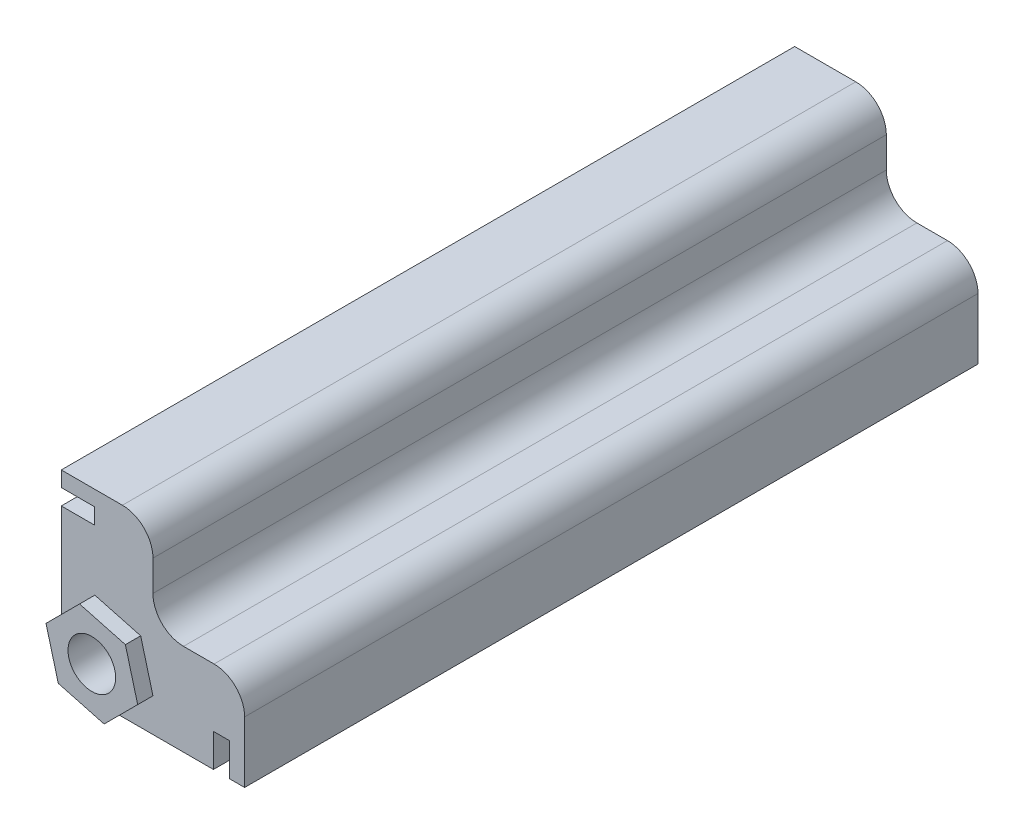
ISO-10303-21;
HEADER;
FILE_DESCRIPTION(('STEP AP214'),'2;1');
FILE_NAME('part.step','',(''),(''),'','','');
FILE_SCHEMA(('AUTOMOTIVE_DESIGN { 1 0 10303 214 1 1 1 1 }'));
ENDSEC;
DATA;
#1=APPLICATION_CONTEXT('core data for automotive mechanical design processes');
#2=APPLICATION_PROTOCOL_DEFINITION('international standard','automotive_design',2000,#1);
#3=PRODUCT_CONTEXT('',#1,'mechanical');
#4=PRODUCT('Part','Part','',(#3));
#5=PRODUCT_RELATED_PRODUCT_CATEGORY('part','',(#4));
#6=PRODUCT_DEFINITION_FORMATION('','',#4);
#7=PRODUCT_DEFINITION_CONTEXT('part definition',#1,'design');
#8=PRODUCT_DEFINITION('design','',#6,#7);
#9=PRODUCT_DEFINITION_SHAPE('','',#8);
#10=(LENGTH_UNIT() NAMED_UNIT(*) SI_UNIT(.MILLI.,.METRE.));
#11=(NAMED_UNIT(*) PLANE_ANGLE_UNIT() SI_UNIT($,.RADIAN.));
#12=(NAMED_UNIT(*) SI_UNIT($,.STERADIAN.) SOLID_ANGLE_UNIT());
#13=UNCERTAINTY_MEASURE_WITH_UNIT(LENGTH_MEASURE(1.E-05),#10,'distance_accuracy_value','');
#14=(GEOMETRIC_REPRESENTATION_CONTEXT(3) GLOBAL_UNCERTAINTY_ASSIGNED_CONTEXT((#13)) GLOBAL_UNIT_ASSIGNED_CONTEXT((#10,
#11,#12)) REPRESENTATION_CONTEXT('',''));
#15=CARTESIAN_POINT('',(0.,0.,0.));
#16=DIRECTION('',(0.,0.,1.));
#17=DIRECTION('',(1.,0.,0.));
#18=AXIS2_PLACEMENT_3D('',#15,#16,#17);
#19=CARTESIAN_POINT('',(0.,0.,152.4));
#20=DIRECTION('',(0.,0.,-1.));
#21=DIRECTION('',(-1.,0.,0.));
#22=AXIS2_PLACEMENT_3D('',#19,#20,#21);
#23=PLANE('',#22);
#24=DIRECTION('',(0.,1.,0.));
#25=VECTOR('',#24,1.);
#26=CARTESIAN_POINT('',(38.1,19.05,152.4));
#27=LINE('',#26,#25);
#28=CARTESIAN_POINT('',(38.1,0.,152.4));
#29=VERTEX_POINT('',#28);
#30=CARTESIAN_POINT('',(38.1,12.7,152.4));
#31=VERTEX_POINT('',#30);
#32=EDGE_CURVE('E278',#29,#31,#27,.T.);
#33=ORIENTED_EDGE('',*,*,#32,.T.);
#34=CARTESIAN_POINT('',(31.75,12.7,152.4));
#35=DIRECTION('',(0.,0.,-1.));
#36=DIRECTION('',(-1.,0.,0.));
#37=AXIS2_PLACEMENT_3D('',#34,#35,#36);
#38=CIRCLE('',#37,6.35);
#39=CARTESIAN_POINT('',(31.75,19.05,152.4));
#40=VERTEX_POINT('',#39);
#41=EDGE_CURVE('E336',#31,#40,#38,.F.);
#42=ORIENTED_EDGE('',*,*,#41,.T.);
#43=DIRECTION('',(-1.,0.,0.));
#44=VECTOR('',#43,1.);
#45=CARTESIAN_POINT('',(19.05,19.05,152.4));
#46=LINE('',#45,#44);
#47=CARTESIAN_POINT('',(25.4,19.05,152.4));
#48=VERTEX_POINT('',#47);
#49=EDGE_CURVE('E282',#40,#48,#46,.T.);
#50=ORIENTED_EDGE('',*,*,#49,.T.);
#51=CARTESIAN_POINT('',(25.4,25.4,152.4));
#52=DIRECTION('',(0.,0.,-1.));
#53=DIRECTION('',(-1.,0.,0.));
#54=AXIS2_PLACEMENT_3D('',#51,#52,#53);
#55=CIRCLE('',#54,6.35);
#56=CARTESIAN_POINT('',(19.05,25.4,152.4));
#57=VERTEX_POINT('',#56);
#58=EDGE_CURVE('E11',#48,#57,#55,.T.);
#59=ORIENTED_EDGE('',*,*,#58,.T.);
#60=DIRECTION('',(0.,1.,0.));
#61=VECTOR('',#60,1.);
#62=CARTESIAN_POINT('',(19.05,38.1,152.4));
#63=LINE('',#62,#61);
#64=CARTESIAN_POINT('',(19.05,31.75,152.4));
#65=VERTEX_POINT('',#64);
#66=EDGE_CURVE('E285',#57,#65,#63,.T.);
#67=ORIENTED_EDGE('',*,*,#66,.T.);
#68=CARTESIAN_POINT('',(12.7,31.75,152.4));
#69=DIRECTION('',(0.,0.,-1.));
#70=DIRECTION('',(-1.,0.,0.));
#71=AXIS2_PLACEMENT_3D('',#68,#69,#70);
#72=CIRCLE('',#71,6.35);
#73=CARTESIAN_POINT('',(12.7,38.1,152.4));
#74=VERTEX_POINT('',#73);
#75=EDGE_CURVE('E49',#65,#74,#72,.F.);
#76=ORIENTED_EDGE('',*,*,#75,.T.);
#77=DIRECTION('',(-1.,0.,0.));
#78=VECTOR('',#77,1.);
#79=CARTESIAN_POINT('',(0.,38.1,152.4));
#80=LINE('',#79,#78);
#81=CARTESIAN_POINT('',(0.,38.1,152.4));
#82=VERTEX_POINT('',#81);
#83=EDGE_CURVE('E287',#74,#82,#80,.T.);
#84=ORIENTED_EDGE('',*,*,#83,.T.);
#85=DIRECTION('',(0.,-1.,0.));
#86=VECTOR('',#85,1.);
#87=CARTESIAN_POINT('',(0.,0.,152.4));
#88=LINE('',#87,#86);
#89=CARTESIAN_POINT('',(0.,34.925,152.4));
#90=VERTEX_POINT('',#89);
#91=EDGE_CURVE('E290',#82,#90,#88,.T.);
#92=ORIENTED_EDGE('',*,*,#91,.T.);
#93=DIRECTION('',(-1.,0.,0.));
#94=VECTOR('',#93,1.);
#95=CARTESIAN_POINT('',(0.,34.925,152.4));
#96=LINE('',#95,#94);
#97=CARTESIAN_POINT('',(6.858,34.925,152.4));
#98=VERTEX_POINT('',#97);
#99=EDGE_CURVE('E229',#98,#90,#96,.T.);
#100=ORIENTED_EDGE('',*,*,#99,.F.);
#101=DIRECTION('',(0.,1.,0.));
#102=VECTOR('',#101,1.);
#103=CARTESIAN_POINT('',(6.858,34.925,152.4));
#104=LINE('',#103,#102);
#105=CARTESIAN_POINT('',(6.858,31.623,152.4));
#106=VERTEX_POINT('',#105);
#107=EDGE_CURVE('E239',#106,#98,#104,.T.);
#108=ORIENTED_EDGE('',*,*,#107,.F.);
#109=DIRECTION('',(1.,0.,0.));
#110=VECTOR('',#109,1.);
#111=CARTESIAN_POINT('',(0.,31.623,152.4));
#112=LINE('',#111,#110);
#113=CARTESIAN_POINT('',(0.,31.623,152.4));
#114=VERTEX_POINT('',#113);
#115=EDGE_CURVE('E236',#114,#106,#112,.T.);
#116=ORIENTED_EDGE('',*,*,#115,.F.);
#117=CARTESIAN_POINT('',(0.,12.0772160579064,152.4));
#118=VERTEX_POINT('',#117);
#119=EDGE_CURVE('E294',#114,#118,#88,.T.);
#120=ORIENTED_EDGE('',*,*,#119,.T.);
#121=DIRECTION('',(-0.707106781186547,-0.707106781186548,0.));
#122=VECTOR('',#121,1.);
#123=CARTESIAN_POINT('',(6.97278394209356,19.05,152.4));
#124=LINE('',#123,#122);
#125=CARTESIAN_POINT('',(6.97278394209356,19.05,152.4));
#126=VERTEX_POINT('',#125);
#127=EDGE_CURVE('E666',#126,#118,#124,.T.);
#128=ORIENTED_EDGE('',*,*,#127,.F.);
#129=DIRECTION('',(-0.965925826289068,0.258819045102521,0.));
#130=VECTOR('',#129,1.);
#131=CARTESIAN_POINT('',(16.4977839420936,16.4977839420936,152.4));
#132=LINE('',#131,#130);
#133=CARTESIAN_POINT('',(16.4977839420936,16.4977839420936,152.4));
#134=VERTEX_POINT('',#133);
#135=EDGE_CURVE('E664',#134,#126,#132,.T.);
#136=ORIENTED_EDGE('',*,*,#135,.F.);
#137=DIRECTION('',(-0.258819045102521,0.965925826289068,0.));
#138=VECTOR('',#137,1.);
#139=CARTESIAN_POINT('',(19.05,6.97278394209356,152.4));
#140=LINE('',#139,#138);
#141=CARTESIAN_POINT('',(19.05,6.97278394209356,152.4));
#142=VERTEX_POINT('',#141);
#143=EDGE_CURVE('E215',#142,#134,#140,.T.);
#144=ORIENTED_EDGE('',*,*,#143,.F.);
#145=DIRECTION('',(0.707106781186547,0.707106781186548,0.));
#146=VECTOR('',#145,1.);
#147=CARTESIAN_POINT('',(12.0772160579064,0.,152.4));
#148=LINE('',#147,#146);
#149=CARTESIAN_POINT('',(12.0772160579065,0.,152.4));
#150=VERTEX_POINT('',#149);
#151=EDGE_CURVE('E212',#150,#142,#148,.T.);
#152=ORIENTED_EDGE('',*,*,#151,.F.);
#153=DIRECTION('',(1.,0.,0.));
#154=VECTOR('',#153,1.);
#155=CARTESIAN_POINT('',(38.1,0.,152.4));
#156=LINE('',#155,#154);
#157=CARTESIAN_POINT('',(31.623,0.,152.4));
#158=VERTEX_POINT('',#157);
#159=EDGE_CURVE('E279',#150,#158,#156,.T.);
#160=ORIENTED_EDGE('',*,*,#159,.T.);
#161=DIRECTION('',(0.,-1.,0.));
#162=VECTOR('',#161,1.);
#163=CARTESIAN_POINT('',(31.623,0.,152.4));
#164=LINE('',#163,#162);
#165=CARTESIAN_POINT('',(31.623,6.858,152.4));
#166=VERTEX_POINT('',#165);
#167=EDGE_CURVE('E257',#166,#158,#164,.T.);
#168=ORIENTED_EDGE('',*,*,#167,.F.);
#169=DIRECTION('',(-1.,0.,0.));
#170=VECTOR('',#169,1.);
#171=CARTESIAN_POINT('',(34.925,6.858,152.4));
#172=LINE('',#171,#170);
#173=CARTESIAN_POINT('',(34.925,6.858,152.4));
#174=VERTEX_POINT('',#173);
#175=EDGE_CURVE('E219',#174,#166,#172,.T.);
#176=ORIENTED_EDGE('',*,*,#175,.F.);
#177=DIRECTION('',(0.,1.,0.));
#178=VECTOR('',#177,1.);
#179=CARTESIAN_POINT('',(34.925,0.,152.4));
#180=LINE('',#179,#178);
#181=CARTESIAN_POINT('',(34.925,0.,152.4));
#182=VERTEX_POINT('',#181);
#183=EDGE_CURVE('E216',#182,#174,#180,.T.);
#184=ORIENTED_EDGE('',*,*,#183,.F.);
#185=EDGE_CURVE('E280',#182,#29,#156,.T.);
#186=ORIENTED_EDGE('',*,*,#185,.T.);
#187=EDGE_LOOP('',(#33,#42,#50,#59,#67,#76,#84,#92,#100,#108,#116,#120,#128,#136,#144,#152,#160,
#168,#176,#184,#186));
#188=FACE_BOUND('',#187,.T.);
#189=ADVANCED_FACE('F34',(#188),#23,.F.);
#190=DIRECTION('',(0.965925826289068,-0.258819045102521,0.));
#191=VECTOR('',#190,1.);
#192=CARTESIAN_POINT('',(2.55221605790646,2.55221605790644,152.4));
#193=LINE('',#192,#191);
#194=CARTESIAN_POINT('',(2.55221605790646,2.55221605790644,152.4));
#195=VERTEX_POINT('',#194);
#196=EDGE_CURVE('E669',#195,#150,#193,.T.);
#197=ORIENTED_EDGE('',*,*,#196,.F.);
#198=DIRECTION('',(0.258819045102521,-0.965925826289068,0.));
#199=VECTOR('',#198,1.);
#200=CARTESIAN_POINT('',(0.,12.0772160579064,152.4));
#201=LINE('',#200,#199);
#202=EDGE_CURVE('E392',#118,#195,#201,.T.);
#203=ORIENTED_EDGE('',*,*,#202,.F.);
#204=CARTESIAN_POINT('',(0.,0.,152.4));
#205=VERTEX_POINT('',#204);
#206=EDGE_CURVE('E289',#118,#205,#88,.T.);
#207=ORIENTED_EDGE('',*,*,#206,.T.);
#208=EDGE_CURVE('E275',#205,#150,#156,.T.);
#209=ORIENTED_EDGE('',*,*,#208,.T.);
#210=EDGE_LOOP('',(#197,#203,#207,#209));
#211=FACE_BOUND('',#210,.T.);
#212=ADVANCED_FACE('F388',(#211),#23,.F.);
#213=CARTESIAN_POINT('',(38.1,0.,152.4));
#214=DIRECTION('',(0.,1.,0.));
#215=DIRECTION('',(-1.,0.,0.));
#216=AXIS2_PLACEMENT_3D('',#213,#214,#215);
#217=PLANE('',#216);
#218=ORIENTED_EDGE('',*,*,#185,.F.);
#219=DIRECTION('',(0.,0.,1.));
#220=VECTOR('',#219,1.);
#221=CARTESIAN_POINT('',(34.925,0.,0.));
#222=LINE('',#221,#220);
#223=CARTESIAN_POINT('',(34.925,0.,0.));
#224=VERTEX_POINT('',#223);
#225=EDGE_CURVE('E240',#224,#182,#222,.T.);
#226=ORIENTED_EDGE('',*,*,#225,.F.);
#227=DIRECTION('',(1.,0.,0.));
#228=VECTOR('',#227,1.);
#229=CARTESIAN_POINT('',(38.1,0.,0.));
#230=LINE('',#229,#228);
#231=CARTESIAN_POINT('',(38.1,0.,0.));
#232=VERTEX_POINT('',#231);
#233=EDGE_CURVE('E247',#224,#232,#230,.T.);
#234=ORIENTED_EDGE('',*,*,#233,.T.);
#235=DIRECTION('',(0.,0.,-1.));
#236=VECTOR('',#235,1.);
#237=CARTESIAN_POINT('',(38.1,0.,152.4));
#238=LINE('',#237,#236);
#239=EDGE_CURVE('E317',#29,#232,#238,.T.);
#240=ORIENTED_EDGE('',*,*,#239,.F.);
#241=EDGE_LOOP('',(#218,#226,#234,#240));
#242=FACE_BOUND('',#241,.T.);
#243=ADVANCED_FACE('F406',(#242),#217,.F.);
#244=CARTESIAN_POINT('',(0.,0.,152.4));
#245=DIRECTION('',(1.,0.,0.));
#246=DIRECTION('',(0.,0.,-1.));
#247=AXIS2_PLACEMENT_3D('',#244,#245,#246);
#248=PLANE('',#247);
#249=DIRECTION('',(0.,-1.,0.));
#250=VECTOR('',#249,1.);
#251=CARTESIAN_POINT('',(0.,0.,0.));
#252=LINE('',#251,#250);
#253=CARTESIAN_POINT('',(0.,38.1,0.));
#254=VERTEX_POINT('',#253);
#255=CARTESIAN_POINT('',(0.,34.925,0.));
#256=VERTEX_POINT('',#255);
#257=EDGE_CURVE('E309',#254,#256,#252,.T.);
#258=ORIENTED_EDGE('',*,*,#257,.T.);
#259=DIRECTION('',(0.,0.,1.));
#260=VECTOR('',#259,1.);
#261=CARTESIAN_POINT('',(0.,34.925,0.));
#262=LINE('',#261,#260);
#263=EDGE_CURVE('E244',#256,#90,#262,.T.);
#264=ORIENTED_EDGE('',*,*,#263,.T.);
#265=ORIENTED_EDGE('',*,*,#91,.F.);
#266=DIRECTION('',(0.,0.,-1.));
#267=VECTOR('',#266,1.);
#268=CARTESIAN_POINT('',(0.,38.1,152.4));
#269=LINE('',#268,#267);
#270=EDGE_CURVE('E314',#82,#254,#269,.T.);
#271=ORIENTED_EDGE('',*,*,#270,.T.);
#272=EDGE_LOOP('',(#258,#264,#265,#271));
#273=FACE_BOUND('',#272,.T.);
#274=ADVANCED_FACE('F366',(#273),#248,.F.);
#275=CARTESIAN_POINT('',(0.,0.,0.));
#276=VERTEX_POINT('',#275);
#277=CARTESIAN_POINT('',(31.623,0.,0.));
#278=VERTEX_POINT('',#277);
#279=EDGE_CURVE('E295',#276,#278,#230,.T.);
#280=ORIENTED_EDGE('',*,*,#279,.T.);
#281=DIRECTION('',(0.,0.,1.));
#282=VECTOR('',#281,1.);
#283=CARTESIAN_POINT('',(31.623,0.,0.));
#284=LINE('',#283,#282);
#285=EDGE_CURVE('E269',#278,#158,#284,.T.);
#286=ORIENTED_EDGE('',*,*,#285,.T.);
#287=ORIENTED_EDGE('',*,*,#159,.F.);
#288=ORIENTED_EDGE('',*,*,#208,.F.);
#289=DIRECTION('',(0.,0.,-1.));
#290=VECTOR('',#289,1.);
#291=CARTESIAN_POINT('',(0.,0.,152.4));
#292=LINE('',#291,#290);
#293=EDGE_CURVE('E293',#205,#276,#292,.T.);
#294=ORIENTED_EDGE('',*,*,#293,.T.);
#295=EDGE_LOOP('',(#280,#286,#287,#288,#294));
#296=FACE_BOUND('',#295,.T.);
#297=ADVANCED_FACE('F396',(#296),#217,.F.);
#298=CARTESIAN_POINT('',(38.1,19.05,152.4));
#299=DIRECTION('',(-1.,0.,0.));
#300=DIRECTION('',(0.,-1.,0.));
#301=AXIS2_PLACEMENT_3D('',#298,#299,#300);
#302=PLANE('',#301);
#303=DIRECTION('',(0.,1.,0.));
#304=VECTOR('',#303,1.);
#305=CARTESIAN_POINT('',(38.1,19.05,0.));
#306=LINE('',#305,#304);
#307=CARTESIAN_POINT('',(38.1,12.7,0.));
#308=VERTEX_POINT('',#307);
#309=EDGE_CURVE('E298',#232,#308,#306,.T.);
#310=ORIENTED_EDGE('',*,*,#309,.T.);
#311=DIRECTION('',(0.,0.,-1.));
#312=VECTOR('',#311,1.);
#313=CARTESIAN_POINT('',(38.1,12.7,152.4));
#314=LINE('',#313,#312);
#315=EDGE_CURVE('E57',#308,#31,#314,.F.);
#316=ORIENTED_EDGE('',*,*,#315,.T.);
#317=ORIENTED_EDGE('',*,*,#32,.F.);
#318=ORIENTED_EDGE('',*,*,#239,.T.);
#319=EDGE_LOOP('',(#310,#316,#317,#318));
#320=FACE_BOUND('',#319,.T.);
#321=ADVANCED_FACE('F405',(#320),#302,.F.);
#322=CARTESIAN_POINT('',(19.05,19.05,152.4));
#323=DIRECTION('',(0.,-1.,0.));
#324=DIRECTION('',(0.,0.,-1.));
#325=AXIS2_PLACEMENT_3D('',#322,#323,#324);
#326=PLANE('',#325);
#327=DIRECTION('',(-1.,0.,0.));
#328=VECTOR('',#327,1.);
#329=CARTESIAN_POINT('',(19.05,19.05,0.));
#330=LINE('',#329,#328);
#331=CARTESIAN_POINT('',(31.75,19.05,0.));
#332=VERTEX_POINT('',#331);
#333=CARTESIAN_POINT('',(25.4,19.05,0.));
#334=VERTEX_POINT('',#333);
#335=EDGE_CURVE('E300',#332,#334,#330,.T.);
#336=ORIENTED_EDGE('',*,*,#335,.T.);
#337=DIRECTION('',(0.,0.,-1.));
#338=VECTOR('',#337,1.);
#339=CARTESIAN_POINT('',(25.4,19.05,152.4));
#340=LINE('',#339,#338);
#341=EDGE_CURVE('E328',#334,#48,#340,.F.);
#342=ORIENTED_EDGE('',*,*,#341,.T.);
#343=ORIENTED_EDGE('',*,*,#49,.F.);
#344=DIRECTION('',(0.,0.,-1.));
#345=VECTOR('',#344,1.);
#346=CARTESIAN_POINT('',(31.75,19.05,152.4));
#347=LINE('',#346,#345);
#348=EDGE_CURVE('E325',#40,#332,#347,.T.);
#349=ORIENTED_EDGE('',*,*,#348,.T.);
#350=EDGE_LOOP('',(#336,#342,#343,#349));
#351=FACE_BOUND('',#350,.T.);
#352=ADVANCED_FACE('F348',(#351),#326,.F.);
#353=CARTESIAN_POINT('',(19.05,38.1,152.4));
#354=DIRECTION('',(-1.,0.,0.));
#355=DIRECTION('',(0.,-1.,0.));
#356=AXIS2_PLACEMENT_3D('',#353,#354,#355);
#357=PLANE('',#356);
#358=ORIENTED_EDGE('',*,*,#66,.F.);
#359=DIRECTION('',(0.,0.,-1.));
#360=VECTOR('',#359,1.);
#361=CARTESIAN_POINT('',(19.05,25.4,0.));
#362=LINE('',#361,#360);
#363=CARTESIAN_POINT('',(19.05,25.4,0.));
#364=VERTEX_POINT('',#363);
#365=EDGE_CURVE('E322',#57,#364,#362,.T.);
#366=ORIENTED_EDGE('',*,*,#365,.T.);
#367=DIRECTION('',(0.,1.,0.));
#368=VECTOR('',#367,1.);
#369=CARTESIAN_POINT('',(19.05,38.1,0.));
#370=LINE('',#369,#368);
#371=CARTESIAN_POINT('',(19.05,31.75,0.));
#372=VERTEX_POINT('',#371);
#373=EDGE_CURVE('E303',#364,#372,#370,.T.);
#374=ORIENTED_EDGE('',*,*,#373,.T.);
#375=DIRECTION('',(0.,0.,-1.));
#376=VECTOR('',#375,1.);
#377=CARTESIAN_POINT('',(19.05,31.75,152.4));
#378=LINE('',#377,#376);
#379=EDGE_CURVE('E320',#372,#65,#378,.F.);
#380=ORIENTED_EDGE('',*,*,#379,.T.);
#381=EDGE_LOOP('',(#358,#366,#374,#380));
#382=FACE_BOUND('',#381,.T.);
#383=ADVANCED_FACE('F355',(#382),#357,.F.);
#384=CARTESIAN_POINT('',(0.,38.1,152.4));
#385=DIRECTION('',(0.,-1.,0.));
#386=DIRECTION('',(0.,0.,-1.));
#387=AXIS2_PLACEMENT_3D('',#384,#385,#386);
#388=PLANE('',#387);
#389=ORIENTED_EDGE('',*,*,#83,.F.);
#390=DIRECTION('',(0.,0.,-1.));
#391=VECTOR('',#390,1.);
#392=CARTESIAN_POINT('',(12.7,38.1,152.4));
#393=LINE('',#392,#391);
#394=CARTESIAN_POINT('',(12.7,38.1,0.));
#395=VERTEX_POINT('',#394);
#396=EDGE_CURVE('E338',#74,#395,#393,.T.);
#397=ORIENTED_EDGE('',*,*,#396,.T.);
#398=DIRECTION('',(-1.,0.,0.));
#399=VECTOR('',#398,1.);
#400=CARTESIAN_POINT('',(0.,38.1,0.));
#401=LINE('',#400,#399);
#402=EDGE_CURVE('E306',#395,#254,#401,.T.);
#403=ORIENTED_EDGE('',*,*,#402,.T.);
#404=ORIENTED_EDGE('',*,*,#270,.F.);
#405=EDGE_LOOP('',(#389,#397,#403,#404));
#406=FACE_BOUND('',#405,.T.);
#407=ADVANCED_FACE('F361',(#406),#388,.F.);
#408=ORIENTED_EDGE('',*,*,#119,.F.);
#409=DIRECTION('',(0.,0.,1.));
#410=VECTOR('',#409,1.);
#411=CARTESIAN_POINT('',(0.,31.623,0.));
#412=LINE('',#411,#410);
#413=CARTESIAN_POINT('',(0.,31.623,0.));
#414=VERTEX_POINT('',#413);
#415=EDGE_CURVE('E235',#414,#114,#412,.T.);
#416=ORIENTED_EDGE('',*,*,#415,.F.);
#417=EDGE_CURVE('E308',#414,#276,#252,.T.);
#418=ORIENTED_EDGE('',*,*,#417,.T.);
#419=ORIENTED_EDGE('',*,*,#293,.F.);
#420=ORIENTED_EDGE('',*,*,#206,.F.);
#421=EDGE_LOOP('',(#408,#416,#418,#419,#420));
#422=FACE_BOUND('',#421,.T.);
#423=ADVANCED_FACE('F384',(#422),#248,.F.);
#424=CARTESIAN_POINT('',(0.,0.,0.));
#425=DIRECTION('',(0.,0.,-1.));
#426=DIRECTION('',(-1.,0.,0.));
#427=AXIS2_PLACEMENT_3D('',#424,#425,#426);
#428=PLANE('',#427);
#429=CARTESIAN_POINT('',(9.525,9.525,0.));
#430=DIRECTION('',(0.,0.,1.));
#431=DIRECTION('',(1.,0.,0.));
#432=AXIS2_PLACEMENT_3D('',#429,#430,#431);
#433=CIRCLE('',#432,4.953);
#434=CARTESIAN_POINT('',(14.478,9.525,0.));
#435=VERTEX_POINT('',#434);
#436=EDGE_CURVE('E649',#435,#435,#433,.T.);
#437=ORIENTED_EDGE('',*,*,#436,.T.);
#438=EDGE_LOOP('',(#437));
#439=FACE_BOUND('',#438,.T.);
#440=ORIENTED_EDGE('',*,*,#335,.F.);
#441=CARTESIAN_POINT('',(31.75,12.7,0.));
#442=DIRECTION('',(0.,0.,-1.));
#443=DIRECTION('',(-1.,0.,0.));
#444=AXIS2_PLACEMENT_3D('',#441,#442,#443);
#445=CIRCLE('',#444,6.35);
#446=EDGE_CURVE('E332',#332,#308,#445,.T.);
#447=ORIENTED_EDGE('',*,*,#446,.T.);
#448=ORIENTED_EDGE('',*,*,#309,.F.);
#449=ORIENTED_EDGE('',*,*,#233,.F.);
#450=DIRECTION('',(0.,1.,0.));
#451=VECTOR('',#450,1.);
#452=CARTESIAN_POINT('',(34.925,0.,0.));
#453=LINE('',#452,#451);
#454=CARTESIAN_POINT('',(34.925,6.858,0.));
#455=VERTEX_POINT('',#454);
#456=EDGE_CURVE('E253',#224,#455,#453,.T.);
#457=ORIENTED_EDGE('',*,*,#456,.T.);
#458=DIRECTION('',(-1.,0.,0.));
#459=VECTOR('',#458,1.);
#460=CARTESIAN_POINT('',(34.925,6.858,0.));
#461=LINE('',#460,#459);
#462=CARTESIAN_POINT('',(31.623,6.858,0.));
#463=VERTEX_POINT('',#462);
#464=EDGE_CURVE('E256',#455,#463,#461,.T.);
#465=ORIENTED_EDGE('',*,*,#464,.T.);
#466=DIRECTION('',(0.,-1.,0.));
#467=VECTOR('',#466,1.);
#468=CARTESIAN_POINT('',(31.623,0.,0.));
#469=LINE('',#468,#467);
#470=EDGE_CURVE('E260',#463,#278,#469,.T.);
#471=ORIENTED_EDGE('',*,*,#470,.T.);
#472=ORIENTED_EDGE('',*,*,#279,.F.);
#473=ORIENTED_EDGE('',*,*,#417,.F.);
#474=DIRECTION('',(1.,0.,0.));
#475=VECTOR('',#474,1.);
#476=CARTESIAN_POINT('',(0.,31.623,0.));
#477=LINE('',#476,#475);
#478=CARTESIAN_POINT('',(6.858,31.623,0.));
#479=VERTEX_POINT('',#478);
#480=EDGE_CURVE('E225',#414,#479,#477,.T.);
#481=ORIENTED_EDGE('',*,*,#480,.T.);
#482=DIRECTION('',(0.,1.,0.));
#483=VECTOR('',#482,1.);
#484=CARTESIAN_POINT('',(6.858,34.925,0.));
#485=LINE('',#484,#483);
#486=CARTESIAN_POINT('',(6.858,34.925,0.));
#487=VERTEX_POINT('',#486);
#488=EDGE_CURVE('E228',#479,#487,#485,.T.);
#489=ORIENTED_EDGE('',*,*,#488,.T.);
#490=DIRECTION('',(-1.,0.,0.));
#491=VECTOR('',#490,1.);
#492=CARTESIAN_POINT('',(0.,34.925,0.));
#493=LINE('',#492,#491);
#494=EDGE_CURVE('E232',#487,#256,#493,.T.);
#495=ORIENTED_EDGE('',*,*,#494,.T.);
#496=ORIENTED_EDGE('',*,*,#257,.F.);
#497=ORIENTED_EDGE('',*,*,#402,.F.);
#498=CARTESIAN_POINT('',(12.7,31.75,0.));
#499=DIRECTION('',(0.,0.,-1.));
#500=DIRECTION('',(-1.,0.,0.));
#501=AXIS2_PLACEMENT_3D('',#498,#499,#500);
#502=CIRCLE('',#501,6.35);
#503=EDGE_CURVE('E330',#395,#372,#502,.T.);
#504=ORIENTED_EDGE('',*,*,#503,.T.);
#505=ORIENTED_EDGE('',*,*,#373,.F.);
#506=CARTESIAN_POINT('',(25.4,25.4,0.));
#507=DIRECTION('',(0.,0.,-1.));
#508=DIRECTION('',(-1.,0.,0.));
#509=AXIS2_PLACEMENT_3D('',#506,#507,#508);
#510=CIRCLE('',#509,6.35);
#511=EDGE_CURVE('E42',#364,#334,#510,.F.);
#512=ORIENTED_EDGE('',*,*,#511,.T.);
#513=EDGE_LOOP('',(#440,#447,#448,#449,#457,#465,#471,#472,#473,#481,#489,#495,#496,#497,#504,
#505,#512));
#514=FACE_BOUND('',#513,.T.);
#515=ADVANCED_FACE('F343',(#439,#514),#428,.T.);
#516=CARTESIAN_POINT('',(34.925,0.,0.));
#517=DIRECTION('',(1.,0.,0.));
#518=DIRECTION('',(0.,0.,-1.));
#519=AXIS2_PLACEMENT_3D('',#516,#517,#518);
#520=PLANE('',#519);
#521=ORIENTED_EDGE('',*,*,#183,.T.);
#522=DIRECTION('',(0.,0.,1.));
#523=VECTOR('',#522,1.);
#524=CARTESIAN_POINT('',(34.925,6.858,0.));
#525=LINE('',#524,#523);
#526=EDGE_CURVE('E262',#455,#174,#525,.T.);
#527=ORIENTED_EDGE('',*,*,#526,.F.);
#528=ORIENTED_EDGE('',*,*,#456,.F.);
#529=ORIENTED_EDGE('',*,*,#225,.T.);
#530=EDGE_LOOP('',(#521,#527,#528,#529));
#531=FACE_BOUND('',#530,.T.);
#532=ADVANCED_FACE('F425',(#531),#520,.F.);
#533=CARTESIAN_POINT('',(31.623,0.,0.));
#534=DIRECTION('',(-1.,0.,0.));
#535=DIRECTION('',(0.,0.,1.));
#536=AXIS2_PLACEMENT_3D('',#533,#534,#535);
#537=PLANE('',#536);
#538=ORIENTED_EDGE('',*,*,#167,.T.);
#539=ORIENTED_EDGE('',*,*,#285,.F.);
#540=ORIENTED_EDGE('',*,*,#470,.F.);
#541=DIRECTION('',(0.,0.,1.));
#542=VECTOR('',#541,1.);
#543=CARTESIAN_POINT('',(31.623,6.858,0.));
#544=LINE('',#543,#542);
#545=EDGE_CURVE('E272',#463,#166,#544,.T.);
#546=ORIENTED_EDGE('',*,*,#545,.T.);
#547=EDGE_LOOP('',(#538,#539,#540,#546));
#548=FACE_BOUND('',#547,.T.);
#549=ADVANCED_FACE('F463',(#548),#537,.F.);
#550=CARTESIAN_POINT('',(34.925,6.858,0.));
#551=DIRECTION('',(0.,1.,0.));
#552=DIRECTION('',(-1.,0.,0.));
#553=AXIS2_PLACEMENT_3D('',#550,#551,#552);
#554=PLANE('',#553);
#555=ORIENTED_EDGE('',*,*,#175,.T.);
#556=ORIENTED_EDGE('',*,*,#545,.F.);
#557=ORIENTED_EDGE('',*,*,#464,.F.);
#558=ORIENTED_EDGE('',*,*,#526,.T.);
#559=EDGE_LOOP('',(#555,#556,#557,#558));
#560=FACE_BOUND('',#559,.T.);
#561=ADVANCED_FACE('F472',(#560),#554,.F.);
#562=CARTESIAN_POINT('',(0.,34.925,0.));
#563=DIRECTION('',(0.,1.,0.));
#564=DIRECTION('',(0.,0.,1.));
#565=AXIS2_PLACEMENT_3D('',#562,#563,#564);
#566=PLANE('',#565);
#567=ORIENTED_EDGE('',*,*,#99,.T.);
#568=ORIENTED_EDGE('',*,*,#263,.F.);
#569=ORIENTED_EDGE('',*,*,#494,.F.);
#570=DIRECTION('',(0.,0.,1.));
#571=VECTOR('',#570,1.);
#572=CARTESIAN_POINT('',(6.858,34.925,0.));
#573=LINE('',#572,#571);
#574=EDGE_CURVE('E248',#487,#98,#573,.T.);
#575=ORIENTED_EDGE('',*,*,#574,.T.);
#576=EDGE_LOOP('',(#567,#568,#569,#575));
#577=FACE_BOUND('',#576,.T.);
#578=ADVANCED_FACE('F372',(#577),#566,.F.);
#579=CARTESIAN_POINT('',(6.858,34.925,0.));
#580=DIRECTION('',(1.,0.,0.));
#581=DIRECTION('',(0.,1.,0.));
#582=AXIS2_PLACEMENT_3D('',#579,#580,#581);
#583=PLANE('',#582);
#584=ORIENTED_EDGE('',*,*,#107,.T.);
#585=ORIENTED_EDGE('',*,*,#574,.F.);
#586=ORIENTED_EDGE('',*,*,#488,.F.);
#587=DIRECTION('',(0.,0.,1.));
#588=VECTOR('',#587,1.);
#589=CARTESIAN_POINT('',(6.858,31.623,0.));
#590=LINE('',#589,#588);
#591=EDGE_CURVE('E250',#479,#106,#590,.T.);
#592=ORIENTED_EDGE('',*,*,#591,.T.);
#593=EDGE_LOOP('',(#584,#585,#586,#592));
#594=FACE_BOUND('',#593,.T.);
#595=ADVANCED_FACE('F374',(#594),#583,.F.);
#596=CARTESIAN_POINT('',(0.,31.623,0.));
#597=DIRECTION('',(0.,-1.,0.));
#598=DIRECTION('',(0.,0.,-1.));
#599=AXIS2_PLACEMENT_3D('',#596,#597,#598);
#600=PLANE('',#599);
#601=ORIENTED_EDGE('',*,*,#115,.T.);
#602=ORIENTED_EDGE('',*,*,#591,.F.);
#603=ORIENTED_EDGE('',*,*,#480,.F.);
#604=ORIENTED_EDGE('',*,*,#415,.T.);
#605=EDGE_LOOP('',(#601,#602,#603,#604));
#606=FACE_BOUND('',#605,.T.);
#607=ADVANCED_FACE('F377',(#606),#600,.F.);
#608=CARTESIAN_POINT('',(19.05,6.97278394209356,155.575));
#609=DIRECTION('',(-0.965925826289068,-0.258819045102521,0.));
#610=DIRECTION('',(0.258819045102521,-0.965925826289068,0.));
#611=AXIS2_PLACEMENT_3D('',#608,#609,#610);
#612=PLANE('',#611);
#613=ORIENTED_EDGE('',*,*,#143,.T.);
#614=DIRECTION('',(0.,0.,-1.));
#615=VECTOR('',#614,1.);
#616=CARTESIAN_POINT('',(16.4977839420936,16.4977839420936,155.575));
#617=LINE('',#616,#615);
#618=CARTESIAN_POINT('',(16.4977839420936,16.4977839420936,155.575));
#619=VERTEX_POINT('',#618);
#620=EDGE_CURVE('E196',#619,#134,#617,.T.);
#621=ORIENTED_EDGE('',*,*,#620,.F.);
#622=DIRECTION('',(-0.258819045102521,0.965925826289068,0.));
#623=VECTOR('',#622,1.);
#624=CARTESIAN_POINT('',(19.05,6.97278394209356,155.575));
#625=LINE('',#624,#623);
#626=CARTESIAN_POINT('',(19.05,6.97278394209356,155.575));
#627=VERTEX_POINT('',#626);
#628=EDGE_CURVE('E203',#627,#619,#625,.T.);
#629=ORIENTED_EDGE('',*,*,#628,.F.);
#630=DIRECTION('',(0.,0.,-1.));
#631=VECTOR('',#630,1.);
#632=CARTESIAN_POINT('',(19.05,6.97278394209356,155.575));
#633=LINE('',#632,#631);
#634=EDGE_CURVE('E662',#627,#142,#633,.T.);
#635=ORIENTED_EDGE('',*,*,#634,.T.);
#636=EDGE_LOOP('',(#613,#621,#629,#635));
#637=FACE_BOUND('',#636,.T.);
#638=ADVANCED_FACE('F214',(#637),#612,.F.);
#639=CARTESIAN_POINT('',(16.4977839420936,16.4977839420936,155.575));
#640=DIRECTION('',(-0.258819045102521,-0.965925826289068,0.));
#641=DIRECTION('',(0.965925826289068,-0.258819045102521,0.));
#642=AXIS2_PLACEMENT_3D('',#639,#640,#641);
#643=PLANE('',#642);
#644=ORIENTED_EDGE('',*,*,#135,.T.);
#645=DIRECTION('',(0.,0.,-1.));
#646=VECTOR('',#645,1.);
#647=CARTESIAN_POINT('',(6.97278394209356,19.05,155.575));
#648=LINE('',#647,#646);
#649=CARTESIAN_POINT('',(6.97278394209356,19.05,155.575));
#650=VERTEX_POINT('',#649);
#651=EDGE_CURVE('E199',#650,#126,#648,.T.);
#652=ORIENTED_EDGE('',*,*,#651,.F.);
#653=DIRECTION('',(-0.965925826289068,0.258819045102521,0.));
#654=VECTOR('',#653,1.);
#655=CARTESIAN_POINT('',(16.4977839420936,16.4977839420936,155.575));
#656=LINE('',#655,#654);
#657=EDGE_CURVE('E191',#619,#650,#656,.T.);
#658=ORIENTED_EDGE('',*,*,#657,.F.);
#659=ORIENTED_EDGE('',*,*,#620,.T.);
#660=EDGE_LOOP('',(#644,#652,#658,#659));
#661=FACE_BOUND('',#660,.T.);
#662=ADVANCED_FACE('F194',(#661),#643,.F.);
#663=CARTESIAN_POINT('',(6.97278394209356,19.05,155.575));
#664=DIRECTION('',(0.707106781186548,-0.707106781186547,0.));
#665=DIRECTION('',(0.707106781186547,0.707106781186548,0.));
#666=AXIS2_PLACEMENT_3D('',#663,#664,#665);
#667=PLANE('',#666);
#668=ORIENTED_EDGE('',*,*,#127,.T.);
#669=DIRECTION('',(0.,0.,-1.));
#670=VECTOR('',#669,1.);
#671=CARTESIAN_POINT('',(0.,12.0772160579064,155.575));
#672=LINE('',#671,#670);
#673=CARTESIAN_POINT('',(0.,12.0772160579064,155.575));
#674=VERTEX_POINT('',#673);
#675=EDGE_CURVE('E221',#674,#118,#672,.T.);
#676=ORIENTED_EDGE('',*,*,#675,.F.);
#677=DIRECTION('',(-0.707106781186547,-0.707106781186548,0.));
#678=VECTOR('',#677,1.);
#679=CARTESIAN_POINT('',(6.97278394209356,19.05,155.575));
#680=LINE('',#679,#678);
#681=EDGE_CURVE('E202',#650,#674,#680,.T.);
#682=ORIENTED_EDGE('',*,*,#681,.F.);
#683=ORIENTED_EDGE('',*,*,#651,.T.);
#684=EDGE_LOOP('',(#668,#676,#682,#683));
#685=FACE_BOUND('',#684,.T.);
#686=ADVANCED_FACE('F539',(#685),#667,.F.);
#687=CARTESIAN_POINT('',(0.,12.0772160579064,155.575));
#688=DIRECTION('',(0.965925826289068,0.258819045102521,0.));
#689=DIRECTION('',(-0.258819045102521,0.965925826289068,0.));
#690=AXIS2_PLACEMENT_3D('',#687,#688,#689);
#691=PLANE('',#690);
#692=ORIENTED_EDGE('',*,*,#202,.T.);
#693=DIRECTION('',(0.,0.,-1.));
#694=VECTOR('',#693,1.);
#695=CARTESIAN_POINT('',(2.55221605790646,2.55221605790644,155.575));
#696=LINE('',#695,#694);
#697=CARTESIAN_POINT('',(2.55221605790646,2.55221605790644,155.575));
#698=VERTEX_POINT('',#697);
#699=EDGE_CURVE('E677',#698,#195,#696,.T.);
#700=ORIENTED_EDGE('',*,*,#699,.F.);
#701=DIRECTION('',(0.258819045102521,-0.965925826289068,0.));
#702=VECTOR('',#701,1.);
#703=CARTESIAN_POINT('',(0.,12.0772160579064,155.575));
#704=LINE('',#703,#702);
#705=EDGE_CURVE('E657',#674,#698,#704,.T.);
#706=ORIENTED_EDGE('',*,*,#705,.F.);
#707=ORIENTED_EDGE('',*,*,#675,.T.);
#708=EDGE_LOOP('',(#692,#700,#706,#707));
#709=FACE_BOUND('',#708,.T.);
#710=ADVANCED_FACE('F548',(#709),#691,.F.);
#711=CARTESIAN_POINT('',(2.55221605790646,2.55221605790644,155.575));
#712=DIRECTION('',(0.258819045102521,0.965925826289068,0.));
#713=DIRECTION('',(-0.965925826289068,0.258819045102521,0.));
#714=AXIS2_PLACEMENT_3D('',#711,#712,#713);
#715=PLANE('',#714);
#716=ORIENTED_EDGE('',*,*,#196,.T.);
#717=DIRECTION('',(0.,0.,-1.));
#718=VECTOR('',#717,1.);
#719=CARTESIAN_POINT('',(12.0772160579064,0.,155.575));
#720=LINE('',#719,#718);
#721=CARTESIAN_POINT('',(12.0772160579064,0.,155.575));
#722=VERTEX_POINT('',#721);
#723=EDGE_CURVE('E674',#722,#150,#720,.T.);
#724=ORIENTED_EDGE('',*,*,#723,.F.);
#725=DIRECTION('',(0.965925826289068,-0.258819045102521,0.));
#726=VECTOR('',#725,1.);
#727=CARTESIAN_POINT('',(2.55221605790646,2.55221605790644,155.575));
#728=LINE('',#727,#726);
#729=EDGE_CURVE('E659',#698,#722,#728,.T.);
#730=ORIENTED_EDGE('',*,*,#729,.F.);
#731=ORIENTED_EDGE('',*,*,#699,.T.);
#732=EDGE_LOOP('',(#716,#724,#730,#731));
#733=FACE_BOUND('',#732,.T.);
#734=ADVANCED_FACE('F558',(#733),#715,.F.);
#735=CARTESIAN_POINT('',(12.0772160579064,0.,155.575));
#736=DIRECTION('',(-0.707106781186548,0.707106781186547,0.));
#737=DIRECTION('',(-0.707106781186547,-0.707106781186548,0.));
#738=AXIS2_PLACEMENT_3D('',#735,#736,#737);
#739=PLANE('',#738);
#740=ORIENTED_EDGE('',*,*,#151,.T.);
#741=ORIENTED_EDGE('',*,*,#634,.F.);
#742=DIRECTION('',(0.707106781186547,0.707106781186548,0.));
#743=VECTOR('',#742,1.);
#744=CARTESIAN_POINT('',(12.0772160579064,0.,155.575));
#745=LINE('',#744,#743);
#746=EDGE_CURVE('E208',#722,#627,#745,.T.);
#747=ORIENTED_EDGE('',*,*,#746,.F.);
#748=ORIENTED_EDGE('',*,*,#723,.T.);
#749=EDGE_LOOP('',(#740,#741,#747,#748));
#750=FACE_BOUND('',#749,.T.);
#751=ADVANCED_FACE('F568',(#750),#739,.F.);
#752=CARTESIAN_POINT('',(0.,0.,155.575));
#753=DIRECTION('',(0.,0.,1.));
#754=DIRECTION('',(1.,0.,0.));
#755=AXIS2_PLACEMENT_3D('',#752,#753,#754);
#756=PLANE('',#755);
#757=CARTESIAN_POINT('',(9.525,9.525,155.575));
#758=DIRECTION('',(0.,0.,1.));
#759=DIRECTION('',(1.,0.,0.));
#760=AXIS2_PLACEMENT_3D('',#757,#758,#759);
#761=CIRCLE('',#760,4.953);
#762=CARTESIAN_POINT('',(14.478,9.525,155.575));
#763=VERTEX_POINT('',#762);
#764=EDGE_CURVE('E652',#763,#763,#761,.T.);
#765=ORIENTED_EDGE('',*,*,#764,.F.);
#766=EDGE_LOOP('',(#765));
#767=FACE_BOUND('',#766,.T.);
#768=ORIENTED_EDGE('',*,*,#628,.T.);
#769=ORIENTED_EDGE('',*,*,#657,.T.);
#770=ORIENTED_EDGE('',*,*,#681,.T.);
#771=ORIENTED_EDGE('',*,*,#705,.T.);
#772=ORIENTED_EDGE('',*,*,#729,.T.);
#773=ORIENTED_EDGE('',*,*,#746,.T.);
#774=EDGE_LOOP('',(#768,#769,#770,#771,#772,#773));
#775=FACE_BOUND('',#774,.T.);
#776=ADVANCED_FACE('F206',(#767,#775),#756,.T.);
#777=CARTESIAN_POINT('',(25.4,25.4,152.4));
#778=DIRECTION('',(0.,0.,1.));
#779=DIRECTION('',(1.,0.,0.));
#780=AXIS2_PLACEMENT_3D('',#777,#778,#779);
#781=CYLINDRICAL_SURFACE('',#780,6.35);
#782=ORIENTED_EDGE('',*,*,#58,.F.);
#783=ORIENTED_EDGE('',*,*,#341,.F.);
#784=ORIENTED_EDGE('',*,*,#511,.F.);
#785=ORIENTED_EDGE('',*,*,#365,.F.);
#786=EDGE_LOOP('',(#782,#783,#784,#785));
#787=FACE_BOUND('',#786,.T.);
#788=ADVANCED_FACE('F352',(#787),#781,.F.);
#789=CARTESIAN_POINT('',(31.75,12.7,152.4));
#790=DIRECTION('',(0.,0.,-1.));
#791=DIRECTION('',(-1.,0.,0.));
#792=AXIS2_PLACEMENT_3D('',#789,#790,#791);
#793=CYLINDRICAL_SURFACE('',#792,6.35);
#794=ORIENTED_EDGE('',*,*,#41,.F.);
#795=ORIENTED_EDGE('',*,*,#315,.F.);
#796=ORIENTED_EDGE('',*,*,#446,.F.);
#797=ORIENTED_EDGE('',*,*,#348,.F.);
#798=EDGE_LOOP('',(#794,#795,#796,#797));
#799=FACE_BOUND('',#798,.T.);
#800=ADVANCED_FACE('F410',(#799),#793,.T.);
#801=CARTESIAN_POINT('',(12.7,31.75,152.4));
#802=DIRECTION('',(0.,0.,-1.));
#803=DIRECTION('',(-1.,0.,0.));
#804=AXIS2_PLACEMENT_3D('',#801,#802,#803);
#805=CYLINDRICAL_SURFACE('',#804,6.35);
#806=ORIENTED_EDGE('',*,*,#75,.F.);
#807=ORIENTED_EDGE('',*,*,#379,.F.);
#808=ORIENTED_EDGE('',*,*,#503,.F.);
#809=ORIENTED_EDGE('',*,*,#396,.F.);
#810=EDGE_LOOP('',(#806,#807,#808,#809));
#811=FACE_BOUND('',#810,.T.);
#812=ADVANCED_FACE('F36',(#811),#805,.T.);
#813=CARTESIAN_POINT('',(9.525,9.525,0.));
#814=DIRECTION('',(0.,0.,1.));
#815=DIRECTION('',(1.,0.,0.));
#816=AXIS2_PLACEMENT_3D('',#813,#814,#815);
#817=CYLINDRICAL_SURFACE('',#816,4.953);
#818=ORIENTED_EDGE('',*,*,#436,.F.);
#819=EDGE_LOOP('',(#818));
#820=FACE_BOUND('',#819,.T.);
#821=ORIENTED_EDGE('',*,*,#764,.T.);
#822=EDGE_LOOP('',(#821));
#823=FACE_BOUND('',#822,.T.);
#824=ADVANCED_FACE('F416',(#820,#823),#817,.F.);
#825=CLOSED_SHELL('',(#189,#212,#243,#274,#297,#321,#352,#383,#407,#423,#515,#532,#549,#561,
#578,#595,#607,#638,#662,#686,#710,#734,#751,#776,#788,#800,#812,#824));
#826=MANIFOLD_SOLID_BREP('B2',#825);
#827=ADVANCED_BREP_SHAPE_REPRESENTATION('',(#18,#826),#14);
#828=SHAPE_DEFINITION_REPRESENTATION(#9,#827);
ENDSEC;
END-ISO-10303-21;
